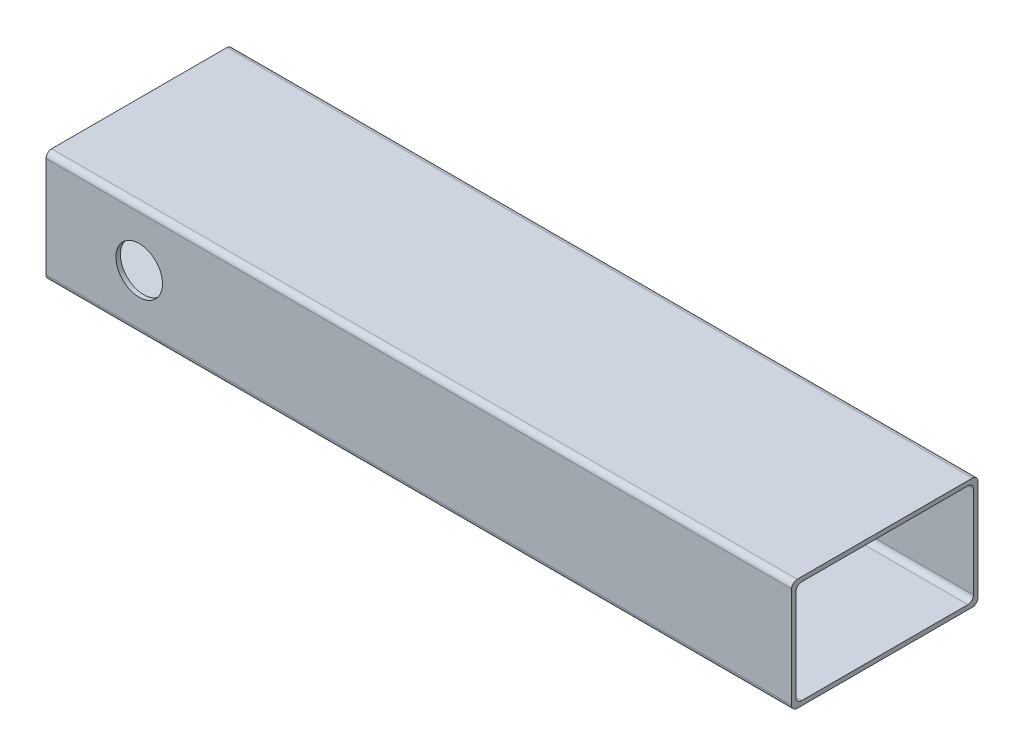
ISO-10303-21;
HEADER;
FILE_DESCRIPTION(('STEP AP214'),'2;1');
FILE_NAME('part.step','',(''),(''),'','','');
FILE_SCHEMA(('AUTOMOTIVE_DESIGN { 1 0 10303 214 1 1 1 1 }'));
ENDSEC;
DATA;
#1=APPLICATION_CONTEXT('core data for automotive mechanical design processes');
#2=APPLICATION_PROTOCOL_DEFINITION('international standard','automotive_design',2000,#1);
#3=PRODUCT_CONTEXT('',#1,'mechanical');
#4=PRODUCT('Part','Part','',(#3));
#5=PRODUCT_RELATED_PRODUCT_CATEGORY('part','',(#4));
#6=PRODUCT_DEFINITION_FORMATION('','',#4);
#7=PRODUCT_DEFINITION_CONTEXT('part definition',#1,'design');
#8=PRODUCT_DEFINITION('design','',#6,#7);
#9=PRODUCT_DEFINITION_SHAPE('','',#8);
#10=(LENGTH_UNIT() NAMED_UNIT(*) SI_UNIT(.MILLI.,.METRE.));
#11=(NAMED_UNIT(*) PLANE_ANGLE_UNIT() SI_UNIT($,.RADIAN.));
#12=(NAMED_UNIT(*) SI_UNIT($,.STERADIAN.) SOLID_ANGLE_UNIT());
#13=UNCERTAINTY_MEASURE_WITH_UNIT(LENGTH_MEASURE(1.E-05),#10,'distance_accuracy_value','');
#14=(GEOMETRIC_REPRESENTATION_CONTEXT(3) GLOBAL_UNCERTAINTY_ASSIGNED_CONTEXT((#13)) GLOBAL_UNIT_ASSIGNED_CONTEXT((#10,
#11,#12)) REPRESENTATION_CONTEXT('',''));
#15=CARTESIAN_POINT('',(0.,0.,0.));
#16=DIRECTION('',(0.,0.,1.));
#17=DIRECTION('',(1.,0.,0.));
#18=AXIS2_PLACEMENT_3D('',#15,#16,#17);
#19=CARTESIAN_POINT('',(-287.748251748252,76.2,-63.9440559440559));
#20=DIRECTION('',(1.,0.,0.));
#21=DIRECTION('',(0.,0.,-1.));
#22=AXIS2_PLACEMENT_3D('',#19,#20,#21);
#23=PLANE('',#22);
#24=DIRECTION('',(0.,0.,1.));
#25=VECTOR('',#24,1.);
#26=CARTESIAN_POINT('',(-287.748251748252,3.048,-60.8960559440559));
#27=LINE('',#26,#25);
#28=CARTESIAN_POINT('',(-287.748251748252,3.048,-57.0860559440559));
#29=VERTEX_POINT('',#28);
#30=CARTESIAN_POINT('',(-287.748251748252,3.048,56.1979440559441));
#31=VERTEX_POINT('',#30);
#32=EDGE_CURVE('E176',#29,#31,#27,.T.);
#33=ORIENTED_EDGE('',*,*,#32,.F.);
#34=CARTESIAN_POINT('',(-287.748251748252,6.858,-57.0860559440559));
#35=DIRECTION('',(1.,0.,0.));
#36=DIRECTION('',(0.,0.,-1.));
#37=AXIS2_PLACEMENT_3D('',#34,#35,#36);
#38=CIRCLE('',#37,3.81);
#39=CARTESIAN_POINT('',(-287.748251748252,6.858,-60.8960559440559));
#40=VERTEX_POINT('',#39);
#41=EDGE_CURVE('E175',#29,#40,#38,.T.);
#42=ORIENTED_EDGE('',*,*,#41,.T.);
#43=DIRECTION('',(0.,-1.,0.));
#44=VECTOR('',#43,1.);
#45=CARTESIAN_POINT('',(-287.748251748252,73.152,-60.8960559440559));
#46=LINE('',#45,#44);
#47=CARTESIAN_POINT('',(-287.748251748252,69.342,-60.8960559440559));
#48=VERTEX_POINT('',#47);
#49=EDGE_CURVE('E166',#48,#40,#46,.T.);
#50=ORIENTED_EDGE('',*,*,#49,.F.);
#51=CARTESIAN_POINT('',(-287.748251748252,69.342,-57.0860559440559));
#52=DIRECTION('',(1.,0.,0.));
#53=DIRECTION('',(0.,0.,-1.));
#54=AXIS2_PLACEMENT_3D('',#51,#52,#53);
#55=CIRCLE('',#54,3.81);
#56=CARTESIAN_POINT('',(-287.748251748252,73.152,-57.0860559440559));
#57=VERTEX_POINT('',#56);
#58=EDGE_CURVE('E149',#48,#57,#55,.T.);
#59=ORIENTED_EDGE('',*,*,#58,.T.);
#60=DIRECTION('',(0.,0.,-1.));
#61=VECTOR('',#60,1.);
#62=CARTESIAN_POINT('',(-287.748251748252,73.152,60.0079440559441));
#63=LINE('',#62,#61);
#64=CARTESIAN_POINT('',(-287.748251748252,73.152,56.1979440559441));
#65=VERTEX_POINT('',#64);
#66=EDGE_CURVE('E190',#65,#57,#63,.T.);
#67=ORIENTED_EDGE('',*,*,#66,.F.);
#68=CARTESIAN_POINT('',(-287.748251748252,69.342,56.1979440559441));
#69=DIRECTION('',(1.,0.,0.));
#70=DIRECTION('',(0.,0.,-1.));
#71=AXIS2_PLACEMENT_3D('',#68,#69,#70);
#72=CIRCLE('',#71,3.81);
#73=CARTESIAN_POINT('',(-287.748251748252,69.342,60.0079440559441));
#74=VERTEX_POINT('',#73);
#75=EDGE_CURVE('E43',#65,#74,#72,.T.);
#76=ORIENTED_EDGE('',*,*,#75,.T.);
#77=DIRECTION('',(0.,1.,0.));
#78=VECTOR('',#77,1.);
#79=CARTESIAN_POINT('',(-287.748251748252,3.048,60.0079440559441));
#80=LINE('',#79,#78);
#81=CARTESIAN_POINT('',(-287.748251748252,6.858,60.0079440559441));
#82=VERTEX_POINT('',#81);
#83=EDGE_CURVE('E180',#82,#74,#80,.T.);
#84=ORIENTED_EDGE('',*,*,#83,.F.);
#85=CARTESIAN_POINT('',(-287.748251748252,6.858,56.1979440559441));
#86=DIRECTION('',(1.,0.,0.));
#87=DIRECTION('',(0.,0.,-1.));
#88=AXIS2_PLACEMENT_3D('',#85,#86,#87);
#89=CIRCLE('',#88,3.81);
#90=EDGE_CURVE('E265',#82,#31,#89,.T.);
#91=ORIENTED_EDGE('',*,*,#90,.T.);
#92=EDGE_LOOP('',(#33,#42,#50,#59,#67,#76,#84,#91));
#93=FACE_BOUND('',#92,.T.);
#94=DIRECTION('',(0.,0.,1.));
#95=VECTOR('',#94,1.);
#96=CARTESIAN_POINT('',(-287.748251748252,76.2,-63.9440559440559));
#97=LINE('',#96,#95);
#98=CARTESIAN_POINT('',(-287.748251748252,76.2,-60.1340559440559));
#99=VERTEX_POINT('',#98);
#100=CARTESIAN_POINT('',(-287.748251748252,76.2,59.2459440559441));
#101=VERTEX_POINT('',#100);
#102=EDGE_CURVE('E192',#99,#101,#97,.T.);
#103=ORIENTED_EDGE('',*,*,#102,.F.);
#104=CARTESIAN_POINT('',(-287.748251748252,72.39,-60.1340559440559));
#105=DIRECTION('',(1.,0.,0.));
#106=DIRECTION('',(0.,0.,-1.));
#107=AXIS2_PLACEMENT_3D('',#104,#105,#106);
#108=CIRCLE('',#107,3.81);
#109=CARTESIAN_POINT('',(-287.748251748252,72.39,-63.9440559440559));
#110=VERTEX_POINT('',#109);
#111=EDGE_CURVE('E241',#99,#110,#108,.F.);
#112=ORIENTED_EDGE('',*,*,#111,.T.);
#113=DIRECTION('',(0.,-1.,0.));
#114=VECTOR('',#113,1.);
#115=CARTESIAN_POINT('',(-287.748251748252,76.2,-63.9440559440559));
#116=LINE('',#115,#114);
#117=CARTESIAN_POINT('',(-287.748251748252,3.81000000000002,-63.9440559440559));
#118=VERTEX_POINT('',#117);
#119=EDGE_CURVE('E199',#110,#118,#116,.T.);
#120=ORIENTED_EDGE('',*,*,#119,.T.);
#121=CARTESIAN_POINT('',(-287.748251748252,3.80999999999999,-60.1340559440559));
#122=DIRECTION('',(1.,0.,0.));
#123=DIRECTION('',(0.,0.,-1.));
#124=AXIS2_PLACEMENT_3D('',#121,#122,#123);
#125=CIRCLE('',#124,3.81);
#126=CARTESIAN_POINT('',(-287.748251748252,0.,-60.1340559440559));
#127=VERTEX_POINT('',#126);
#128=EDGE_CURVE('E239',#118,#127,#125,.F.);
#129=ORIENTED_EDGE('',*,*,#128,.T.);
#130=DIRECTION('',(0.,0.,1.));
#131=VECTOR('',#130,1.);
#132=CARTESIAN_POINT('',(-287.748251748252,0.,-63.9440559440559));
#133=LINE('',#132,#131);
#134=CARTESIAN_POINT('',(-287.748251748252,0.,59.2459440559441));
#135=VERTEX_POINT('',#134);
#136=EDGE_CURVE('E200',#127,#135,#133,.T.);
#137=ORIENTED_EDGE('',*,*,#136,.T.);
#138=CARTESIAN_POINT('',(-287.748251748252,3.80999999999999,59.2459440559441));
#139=DIRECTION('',(1.,0.,0.));
#140=DIRECTION('',(0.,0.,-1.));
#141=AXIS2_PLACEMENT_3D('',#138,#139,#140);
#142=CIRCLE('',#141,3.81);
#143=CARTESIAN_POINT('',(-287.748251748252,3.81000000000002,63.0559440559441));
#144=VERTEX_POINT('',#143);
#145=EDGE_CURVE('E237',#135,#144,#142,.F.);
#146=ORIENTED_EDGE('',*,*,#145,.T.);
#147=DIRECTION('',(0.,-1.,0.));
#148=VECTOR('',#147,1.);
#149=CARTESIAN_POINT('',(-287.748251748252,76.2,63.0559440559441));
#150=LINE('',#149,#148);
#151=CARTESIAN_POINT('',(-287.748251748252,72.39,63.0559440559441));
#152=VERTEX_POINT('',#151);
#153=EDGE_CURVE('E212',#152,#144,#150,.T.);
#154=ORIENTED_EDGE('',*,*,#153,.F.);
#155=CARTESIAN_POINT('',(-287.748251748252,72.39,59.2459440559441));
#156=DIRECTION('',(1.,0.,0.));
#157=DIRECTION('',(0.,0.,-1.));
#158=AXIS2_PLACEMENT_3D('',#155,#156,#157);
#159=CIRCLE('',#158,3.81);
#160=EDGE_CURVE('E235',#152,#101,#159,.F.);
#161=ORIENTED_EDGE('',*,*,#160,.T.);
#162=EDGE_LOOP('',(#103,#112,#120,#129,#137,#146,#154,#161));
#163=FACE_BOUND('',#162,.T.);
#164=ADVANCED_FACE('F34',(#93,#163),#23,.F.);
#165=CARTESIAN_POINT('',(-287.748251748252,76.2,63.0559440559441));
#166=DIRECTION('',(0.,0.,-1.));
#167=DIRECTION('',(-1.,0.,0.));
#168=AXIS2_PLACEMENT_3D('',#165,#166,#167);
#169=PLANE('',#168);
#170=CARTESIAN_POINT('',(-224.248251748252,38.1,63.0559440559441));
#171=DIRECTION('',(0.,0.,1.));
#172=DIRECTION('',(1.,0.,0.));
#173=AXIS2_PLACEMENT_3D('',#170,#171,#172);
#174=CIRCLE('',#173,15.875);
#175=CARTESIAN_POINT('',(-208.373251748252,38.1,63.0559440559441));
#176=VERTEX_POINT('',#175);
#177=EDGE_CURVE('E292',#176,#176,#174,.T.);
#178=ORIENTED_EDGE('',*,*,#177,.F.);
#179=EDGE_LOOP('',(#178));
#180=FACE_BOUND('',#179,.T.);
#181=ORIENTED_EDGE('',*,*,#153,.T.);
#182=DIRECTION('',(1.,0.,0.));
#183=VECTOR('',#182,1.);
#184=CARTESIAN_POINT('',(-287.748251748252,3.80999999999999,63.0559440559441));
#185=LINE('',#184,#183);
#186=CARTESIAN_POINT('',(220.251748251748,3.81000000000002,63.0559440559441));
#187=VERTEX_POINT('',#186);
#188=EDGE_CURVE('E160',#144,#187,#185,.T.);
#189=ORIENTED_EDGE('',*,*,#188,.T.);
#190=DIRECTION('',(0.,-1.,0.));
#191=VECTOR('',#190,1.);
#192=CARTESIAN_POINT('',(220.251748251748,76.2,63.0559440559441));
#193=LINE('',#192,#191);
#194=CARTESIAN_POINT('',(220.251748251748,72.39,63.0559440559441));
#195=VERTEX_POINT('',#194);
#196=EDGE_CURVE('E210',#195,#187,#193,.T.);
#197=ORIENTED_EDGE('',*,*,#196,.F.);
#198=DIRECTION('',(1.,0.,0.));
#199=VECTOR('',#198,1.);
#200=CARTESIAN_POINT('',(-287.748251748252,72.39,63.0559440559441));
#201=LINE('',#200,#199);
#202=EDGE_CURVE('E258',#195,#152,#201,.F.);
#203=ORIENTED_EDGE('',*,*,#202,.T.);
#204=EDGE_LOOP('',(#181,#189,#197,#203));
#205=FACE_BOUND('',#204,.T.);
#206=ADVANCED_FACE('F317',(#180,#205),#169,.F.);
#207=CARTESIAN_POINT('',(220.251748251748,76.2,-63.9440559440559));
#208=DIRECTION('',(-1.,0.,0.));
#209=DIRECTION('',(0.,0.,1.));
#210=AXIS2_PLACEMENT_3D('',#207,#208,#209);
#211=PLANE('',#210);
#212=DIRECTION('',(0.,1.,0.));
#213=VECTOR('',#212,1.);
#214=CARTESIAN_POINT('',(220.251748251748,3.048,60.0079440559441));
#215=LINE('',#214,#213);
#216=CARTESIAN_POINT('',(220.251748251748,6.858,60.0079440559441));
#217=VERTEX_POINT('',#216);
#218=CARTESIAN_POINT('',(220.251748251748,69.342,60.0079440559441));
#219=VERTEX_POINT('',#218);
#220=EDGE_CURVE('E284',#217,#219,#215,.T.);
#221=ORIENTED_EDGE('',*,*,#220,.T.);
#222=CARTESIAN_POINT('',(220.251748251748,69.342,56.1979440559441));
#223=DIRECTION('',(-1.,0.,0.));
#224=DIRECTION('',(0.,0.,1.));
#225=AXIS2_PLACEMENT_3D('',#222,#223,#224);
#226=CIRCLE('',#225,3.81);
#227=CARTESIAN_POINT('',(220.251748251748,73.152,56.1979440559441));
#228=VERTEX_POINT('',#227);
#229=EDGE_CURVE('E12',#219,#228,#226,.T.);
#230=ORIENTED_EDGE('',*,*,#229,.T.);
#231=DIRECTION('',(0.,0.,-1.));
#232=VECTOR('',#231,1.);
#233=CARTESIAN_POINT('',(220.251748251748,73.152,60.0079440559441));
#234=LINE('',#233,#232);
#235=CARTESIAN_POINT('',(220.251748251748,73.152,-57.0860559440559));
#236=VERTEX_POINT('',#235);
#237=EDGE_CURVE('E185',#228,#236,#234,.T.);
#238=ORIENTED_EDGE('',*,*,#237,.T.);
#239=CARTESIAN_POINT('',(220.251748251748,69.342,-57.0860559440559));
#240=DIRECTION('',(-1.,0.,0.));
#241=DIRECTION('',(0.,0.,1.));
#242=AXIS2_PLACEMENT_3D('',#239,#240,#241);
#243=CIRCLE('',#242,3.81);
#244=CARTESIAN_POINT('',(220.251748251748,69.342,-60.8960559440559));
#245=VERTEX_POINT('',#244);
#246=EDGE_CURVE('E159',#236,#245,#243,.T.);
#247=ORIENTED_EDGE('',*,*,#246,.T.);
#248=DIRECTION('',(0.,-1.,0.));
#249=VECTOR('',#248,1.);
#250=CARTESIAN_POINT('',(220.251748251748,73.152,-60.8960559440559));
#251=LINE('',#250,#249);
#252=CARTESIAN_POINT('',(220.251748251748,6.858,-60.8960559440559));
#253=VERTEX_POINT('',#252);
#254=EDGE_CURVE('E169',#245,#253,#251,.T.);
#255=ORIENTED_EDGE('',*,*,#254,.T.);
#256=CARTESIAN_POINT('',(220.251748251748,6.858,-57.0860559440559));
#257=DIRECTION('',(-1.,0.,0.));
#258=DIRECTION('',(0.,0.,1.));
#259=AXIS2_PLACEMENT_3D('',#256,#257,#258);
#260=CIRCLE('',#259,3.81);
#261=CARTESIAN_POINT('',(220.251748251748,3.048,-57.0860559440559));
#262=VERTEX_POINT('',#261);
#263=EDGE_CURVE('E263',#253,#262,#260,.T.);
#264=ORIENTED_EDGE('',*,*,#263,.T.);
#265=DIRECTION('',(0.,0.,1.));
#266=VECTOR('',#265,1.);
#267=CARTESIAN_POINT('',(220.251748251748,3.048,-60.8960559440559));
#268=LINE('',#267,#266);
#269=CARTESIAN_POINT('',(220.251748251748,3.048,56.1979440559441));
#270=VERTEX_POINT('',#269);
#271=EDGE_CURVE('E287',#262,#270,#268,.T.);
#272=ORIENTED_EDGE('',*,*,#271,.T.);
#273=CARTESIAN_POINT('',(220.251748251748,6.858,56.1979440559441));
#274=DIRECTION('',(-1.,0.,0.));
#275=DIRECTION('',(0.,0.,1.));
#276=AXIS2_PLACEMENT_3D('',#273,#274,#275);
#277=CIRCLE('',#276,3.81);
#278=EDGE_CURVE('E267',#270,#217,#277,.T.);
#279=ORIENTED_EDGE('',*,*,#278,.T.);
#280=EDGE_LOOP('',(#221,#230,#238,#247,#255,#264,#272,#279));
#281=FACE_BOUND('',#280,.T.);
#282=DIRECTION('',(0.,-1.,0.));
#283=VECTOR('',#282,1.);
#284=CARTESIAN_POINT('',(220.251748251748,76.2,-63.9440559440559));
#285=LINE('',#284,#283);
#286=CARTESIAN_POINT('',(220.251748251748,72.39,-63.9440559440559));
#287=VERTEX_POINT('',#286);
#288=CARTESIAN_POINT('',(220.251748251748,3.81000000000002,-63.9440559440559));
#289=VERTEX_POINT('',#288);
#290=EDGE_CURVE('E207',#287,#289,#285,.T.);
#291=ORIENTED_EDGE('',*,*,#290,.F.);
#292=CARTESIAN_POINT('',(220.251748251748,72.39,-60.1340559440559));
#293=DIRECTION('',(-1.,0.,0.));
#294=DIRECTION('',(0.,0.,1.));
#295=AXIS2_PLACEMENT_3D('',#292,#293,#294);
#296=CIRCLE('',#295,3.81);
#297=CARTESIAN_POINT('',(220.251748251748,76.2,-60.1340559440559));
#298=VERTEX_POINT('',#297);
#299=EDGE_CURVE('E252',#287,#298,#296,.F.);
#300=ORIENTED_EDGE('',*,*,#299,.T.);
#301=DIRECTION('',(0.,0.,-1.));
#302=VECTOR('',#301,1.);
#303=CARTESIAN_POINT('',(220.251748251748,76.2,-63.9440559440559));
#304=LINE('',#303,#302);
#305=CARTESIAN_POINT('',(220.251748251748,76.2,59.2459440559441));
#306=VERTEX_POINT('',#305);
#307=EDGE_CURVE('E195',#306,#298,#304,.T.);
#308=ORIENTED_EDGE('',*,*,#307,.F.);
#309=CARTESIAN_POINT('',(220.251748251748,72.39,59.2459440559441));
#310=DIRECTION('',(-1.,0.,0.));
#311=DIRECTION('',(0.,0.,1.));
#312=AXIS2_PLACEMENT_3D('',#309,#310,#311);
#313=CIRCLE('',#312,3.81);
#314=EDGE_CURVE('E58',#306,#195,#313,.F.);
#315=ORIENTED_EDGE('',*,*,#314,.T.);
#316=ORIENTED_EDGE('',*,*,#196,.T.);
#317=CARTESIAN_POINT('',(220.251748251748,3.80999999999999,59.2459440559441));
#318=DIRECTION('',(-1.,0.,0.));
#319=DIRECTION('',(0.,0.,1.));
#320=AXIS2_PLACEMENT_3D('',#317,#318,#319);
#321=CIRCLE('',#320,3.81);
#322=CARTESIAN_POINT('',(220.251748251748,0.,59.2459440559441));
#323=VERTEX_POINT('',#322);
#324=EDGE_CURVE('E50',#187,#323,#321,.F.);
#325=ORIENTED_EDGE('',*,*,#324,.T.);
#326=DIRECTION('',(0.,0.,-1.));
#327=VECTOR('',#326,1.);
#328=CARTESIAN_POINT('',(220.251748251748,0.,-63.9440559440559));
#329=LINE('',#328,#327);
#330=CARTESIAN_POINT('',(220.251748251748,0.,-60.1340559440559));
#331=VERTEX_POINT('',#330);
#332=EDGE_CURVE('E196',#323,#331,#329,.T.);
#333=ORIENTED_EDGE('',*,*,#332,.T.);
#334=CARTESIAN_POINT('',(220.251748251748,3.80999999999999,-60.1340559440559));
#335=DIRECTION('',(-1.,0.,0.));
#336=DIRECTION('',(0.,0.,1.));
#337=AXIS2_PLACEMENT_3D('',#334,#335,#336);
#338=CIRCLE('',#337,3.81);
#339=EDGE_CURVE('E250',#331,#289,#338,.F.);
#340=ORIENTED_EDGE('',*,*,#339,.T.);
#341=EDGE_LOOP('',(#291,#300,#308,#315,#316,#325,#333,#340));
#342=FACE_BOUND('',#341,.T.);
#343=ADVANCED_FACE('F283',(#281,#342),#211,.F.);
#344=CARTESIAN_POINT('',(-287.748251748252,76.2,-63.9440559440559));
#345=DIRECTION('',(0.,0.,1.));
#346=DIRECTION('',(1.,0.,0.));
#347=AXIS2_PLACEMENT_3D('',#344,#345,#346);
#348=PLANE('',#347);
#349=CARTESIAN_POINT('',(-224.248251748252,38.1,-63.9440559440559));
#350=DIRECTION('',(0.,0.,1.));
#351=DIRECTION('',(1.,0.,0.));
#352=AXIS2_PLACEMENT_3D('',#349,#350,#351);
#353=CIRCLE('',#352,15.875);
#354=CARTESIAN_POINT('',(-208.373251748252,38.1,-63.9440559440559));
#355=VERTEX_POINT('',#354);
#356=EDGE_CURVE('E295',#355,#355,#353,.T.);
#357=ORIENTED_EDGE('',*,*,#356,.T.);
#358=EDGE_LOOP('',(#357));
#359=FACE_BOUND('',#358,.T.);
#360=ORIENTED_EDGE('',*,*,#119,.F.);
#361=DIRECTION('',(-1.,0.,0.));
#362=VECTOR('',#361,1.);
#363=CARTESIAN_POINT('',(220.251748251748,72.39,-63.9440559440559));
#364=LINE('',#363,#362);
#365=EDGE_CURVE('E246',#110,#287,#364,.F.);
#366=ORIENTED_EDGE('',*,*,#365,.T.);
#367=ORIENTED_EDGE('',*,*,#290,.T.);
#368=DIRECTION('',(-1.,0.,0.));
#369=VECTOR('',#368,1.);
#370=CARTESIAN_POINT('',(-287.748251748252,3.80999999999999,-63.9440559440559));
#371=LINE('',#370,#369);
#372=EDGE_CURVE('E243',#289,#118,#371,.T.);
#373=ORIENTED_EDGE('',*,*,#372,.T.);
#374=EDGE_LOOP('',(#360,#366,#367,#373));
#375=FACE_BOUND('',#374,.T.);
#376=ADVANCED_FACE('F364',(#359,#375),#348,.F.);
#377=CARTESIAN_POINT('',(0.,76.2,0.));
#378=DIRECTION('',(0.,1.,0.));
#379=DIRECTION('',(0.,0.,1.));
#380=AXIS2_PLACEMENT_3D('',#377,#378,#379);
#381=PLANE('',#380);
#382=ORIENTED_EDGE('',*,*,#307,.T.);
#383=DIRECTION('',(-1.,0.,0.));
#384=VECTOR('',#383,1.);
#385=CARTESIAN_POINT('',(-287.748251748252,76.2,-60.1340559440559));
#386=LINE('',#385,#384);
#387=EDGE_CURVE('E232',#298,#99,#386,.T.);
#388=ORIENTED_EDGE('',*,*,#387,.T.);
#389=ORIENTED_EDGE('',*,*,#102,.T.);
#390=DIRECTION('',(1.,0.,0.));
#391=VECTOR('',#390,1.);
#392=CARTESIAN_POINT('',(220.251748251748,76.2,59.2459440559441));
#393=LINE('',#392,#391);
#394=EDGE_CURVE('E229',#101,#306,#393,.T.);
#395=ORIENTED_EDGE('',*,*,#394,.T.);
#396=EDGE_LOOP('',(#382,#388,#389,#395));
#397=FACE_BOUND('',#396,.T.);
#398=ADVANCED_FACE('F358',(#397),#381,.T.);
#399=CARTESIAN_POINT('',(0.,0.,0.));
#400=DIRECTION('',(0.,1.,0.));
#401=DIRECTION('',(0.,0.,1.));
#402=AXIS2_PLACEMENT_3D('',#399,#400,#401);
#403=PLANE('',#402);
#404=ORIENTED_EDGE('',*,*,#136,.F.);
#405=DIRECTION('',(-1.,0.,0.));
#406=VECTOR('',#405,1.);
#407=CARTESIAN_POINT('',(0.,0.,-60.1340559440559));
#408=LINE('',#407,#406);
#409=EDGE_CURVE('E256',#127,#331,#408,.F.);
#410=ORIENTED_EDGE('',*,*,#409,.T.);
#411=ORIENTED_EDGE('',*,*,#332,.F.);
#412=DIRECTION('',(1.,0.,0.));
#413=VECTOR('',#412,1.);
#414=CARTESIAN_POINT('',(0.,0.,59.2459440559441));
#415=LINE('',#414,#413);
#416=EDGE_CURVE('E254',#323,#135,#415,.F.);
#417=ORIENTED_EDGE('',*,*,#416,.T.);
#418=EDGE_LOOP('',(#404,#410,#411,#417));
#419=FACE_BOUND('',#418,.T.);
#420=ADVANCED_FACE('F370',(#419),#403,.F.);
#421=CARTESIAN_POINT('',(220.251748251748,73.152,-60.8960559440559));
#422=DIRECTION('',(0.,0.,-1.));
#423=DIRECTION('',(-1.,0.,0.));
#424=AXIS2_PLACEMENT_3D('',#421,#422,#423);
#425=PLANE('',#424);
#426=CARTESIAN_POINT('',(-224.248251748252,38.1,-60.8960559440559));
#427=DIRECTION('',(0.,0.,-1.));
#428=DIRECTION('',(-1.,0.,0.));
#429=AXIS2_PLACEMENT_3D('',#426,#427,#428);
#430=CIRCLE('',#429,15.875);
#431=CARTESIAN_POINT('',(-240.123251748252,38.1,-60.8960559440559));
#432=VERTEX_POINT('',#431);
#433=EDGE_CURVE('E177',#432,#432,#430,.T.);
#434=ORIENTED_EDGE('',*,*,#433,.T.);
#435=EDGE_LOOP('',(#434));
#436=FACE_BOUND('',#435,.T.);
#437=ORIENTED_EDGE('',*,*,#254,.F.);
#438=DIRECTION('',(-1.,0.,0.));
#439=VECTOR('',#438,1.);
#440=CARTESIAN_POINT('',(-287.748251748252,69.342,-60.8960559440559));
#441=LINE('',#440,#439);
#442=EDGE_CURVE('E153',#245,#48,#441,.T.);
#443=ORIENTED_EDGE('',*,*,#442,.T.);
#444=ORIENTED_EDGE('',*,*,#49,.T.);
#445=DIRECTION('',(-1.,0.,0.));
#446=VECTOR('',#445,1.);
#447=CARTESIAN_POINT('',(220.251748251748,6.858,-60.8960559440559));
#448=LINE('',#447,#446);
#449=EDGE_CURVE('E171',#40,#253,#448,.F.);
#450=ORIENTED_EDGE('',*,*,#449,.T.);
#451=EDGE_LOOP('',(#437,#443,#444,#450));
#452=FACE_BOUND('',#451,.T.);
#453=ADVANCED_FACE('F165',(#436,#452),#425,.F.);
#454=CARTESIAN_POINT('',(220.251748251748,73.152,60.0079440559441));
#455=DIRECTION('',(0.,1.,0.));
#456=DIRECTION('',(0.,0.,1.));
#457=AXIS2_PLACEMENT_3D('',#454,#455,#456);
#458=PLANE('',#457);
#459=ORIENTED_EDGE('',*,*,#66,.T.);
#460=DIRECTION('',(-1.,0.,0.));
#461=VECTOR('',#460,1.);
#462=CARTESIAN_POINT('',(220.251748251748,73.152,-57.0860559440559));
#463=LINE('',#462,#461);
#464=EDGE_CURVE('E154',#57,#236,#463,.F.);
#465=ORIENTED_EDGE('',*,*,#464,.T.);
#466=ORIENTED_EDGE('',*,*,#237,.F.);
#467=DIRECTION('',(-1.,0.,0.));
#468=VECTOR('',#467,1.);
#469=CARTESIAN_POINT('',(-287.748251748252,73.152,56.1979440559441));
#470=LINE('',#469,#468);
#471=EDGE_CURVE('E170',#228,#65,#470,.T.);
#472=ORIENTED_EDGE('',*,*,#471,.T.);
#473=EDGE_LOOP('',(#459,#465,#466,#472));
#474=FACE_BOUND('',#473,.T.);
#475=ADVANCED_FACE('F286',(#474),#458,.F.);
#476=CARTESIAN_POINT('',(220.251748251748,3.048,60.0079440559441));
#477=DIRECTION('',(0.,0.,1.));
#478=DIRECTION('',(1.,0.,0.));
#479=AXIS2_PLACEMENT_3D('',#476,#477,#478);
#480=PLANE('',#479);
#481=CARTESIAN_POINT('',(-224.248251748252,38.1,60.0079440559441));
#482=DIRECTION('',(0.,0.,1.));
#483=DIRECTION('',(1.,0.,0.));
#484=AXIS2_PLACEMENT_3D('',#481,#482,#483);
#485=CIRCLE('',#484,15.875);
#486=CARTESIAN_POINT('',(-208.373251748252,38.1,60.0079440559441));
#487=VERTEX_POINT('',#486);
#488=EDGE_CURVE('E38',#487,#487,#485,.T.);
#489=ORIENTED_EDGE('',*,*,#488,.T.);
#490=EDGE_LOOP('',(#489));
#491=FACE_BOUND('',#490,.T.);
#492=ORIENTED_EDGE('',*,*,#220,.F.);
#493=DIRECTION('',(-1.,0.,0.));
#494=VECTOR('',#493,1.);
#495=CARTESIAN_POINT('',(-287.748251748252,6.858,60.0079440559441));
#496=LINE('',#495,#494);
#497=EDGE_CURVE('E226',#217,#82,#496,.T.);
#498=ORIENTED_EDGE('',*,*,#497,.T.);
#499=ORIENTED_EDGE('',*,*,#83,.T.);
#500=DIRECTION('',(-1.,0.,0.));
#501=VECTOR('',#500,1.);
#502=CARTESIAN_POINT('',(220.251748251748,69.342,60.0079440559441));
#503=LINE('',#502,#501);
#504=EDGE_CURVE('E224',#74,#219,#503,.F.);
#505=ORIENTED_EDGE('',*,*,#504,.T.);
#506=EDGE_LOOP('',(#492,#498,#499,#505));
#507=FACE_BOUND('',#506,.T.);
#508=ADVANCED_FACE('F275',(#491,#507),#480,.F.);
#509=CARTESIAN_POINT('',(220.251748251748,3.048,-60.8960559440559));
#510=DIRECTION('',(0.,-1.,0.));
#511=DIRECTION('',(0.,0.,-1.));
#512=AXIS2_PLACEMENT_3D('',#509,#510,#511);
#513=PLANE('',#512);
#514=ORIENTED_EDGE('',*,*,#271,.F.);
#515=DIRECTION('',(-1.,0.,0.));
#516=VECTOR('',#515,1.);
#517=CARTESIAN_POINT('',(-287.748251748252,3.048,-57.0860559440559));
#518=LINE('',#517,#516);
#519=EDGE_CURVE('E221',#262,#29,#518,.T.);
#520=ORIENTED_EDGE('',*,*,#519,.T.);
#521=ORIENTED_EDGE('',*,*,#32,.T.);
#522=DIRECTION('',(-1.,0.,0.));
#523=VECTOR('',#522,1.);
#524=CARTESIAN_POINT('',(220.251748251748,3.048,56.1979440559441));
#525=LINE('',#524,#523);
#526=EDGE_CURVE('E219',#31,#270,#525,.F.);
#527=ORIENTED_EDGE('',*,*,#526,.T.);
#528=EDGE_LOOP('',(#514,#520,#521,#527));
#529=FACE_BOUND('',#528,.T.);
#530=ADVANCED_FACE('F329',(#529),#513,.F.);
#531=CARTESIAN_POINT('',(220.251748251748,69.342,-57.0860559440559));
#532=DIRECTION('',(1.,0.,0.));
#533=DIRECTION('',(0.,0.,-1.));
#534=AXIS2_PLACEMENT_3D('',#531,#532,#533);
#535=CYLINDRICAL_SURFACE('',#534,3.81);
#536=ORIENTED_EDGE('',*,*,#246,.F.);
#537=ORIENTED_EDGE('',*,*,#464,.F.);
#538=ORIENTED_EDGE('',*,*,#58,.F.);
#539=ORIENTED_EDGE('',*,*,#442,.F.);
#540=EDGE_LOOP('',(#536,#537,#538,#539));
#541=FACE_BOUND('',#540,.T.);
#542=ADVANCED_FACE('F152',(#541),#535,.F.);
#543=CARTESIAN_POINT('',(220.251748251748,6.858,-57.0860559440559));
#544=DIRECTION('',(1.,0.,0.));
#545=DIRECTION('',(0.,0.,-1.));
#546=AXIS2_PLACEMENT_3D('',#543,#544,#545);
#547=CYLINDRICAL_SURFACE('',#546,3.81);
#548=ORIENTED_EDGE('',*,*,#263,.F.);
#549=ORIENTED_EDGE('',*,*,#449,.F.);
#550=ORIENTED_EDGE('',*,*,#41,.F.);
#551=ORIENTED_EDGE('',*,*,#519,.F.);
#552=EDGE_LOOP('',(#548,#549,#550,#551));
#553=FACE_BOUND('',#552,.T.);
#554=ADVANCED_FACE('F328',(#553),#547,.F.);
#555=CARTESIAN_POINT('',(220.251748251748,6.858,56.1979440559441));
#556=DIRECTION('',(1.,0.,0.));
#557=DIRECTION('',(0.,0.,-1.));
#558=AXIS2_PLACEMENT_3D('',#555,#556,#557);
#559=CYLINDRICAL_SURFACE('',#558,3.81);
#560=ORIENTED_EDGE('',*,*,#278,.F.);
#561=ORIENTED_EDGE('',*,*,#526,.F.);
#562=ORIENTED_EDGE('',*,*,#90,.F.);
#563=ORIENTED_EDGE('',*,*,#497,.F.);
#564=EDGE_LOOP('',(#560,#561,#562,#563));
#565=FACE_BOUND('',#564,.T.);
#566=ADVANCED_FACE('F332',(#565),#559,.F.);
#567=CARTESIAN_POINT('',(220.251748251748,69.342,56.1979440559441));
#568=DIRECTION('',(1.,0.,0.));
#569=DIRECTION('',(0.,0.,-1.));
#570=AXIS2_PLACEMENT_3D('',#567,#568,#569);
#571=CYLINDRICAL_SURFACE('',#570,3.81);
#572=ORIENTED_EDGE('',*,*,#229,.F.);
#573=ORIENTED_EDGE('',*,*,#504,.F.);
#574=ORIENTED_EDGE('',*,*,#75,.F.);
#575=ORIENTED_EDGE('',*,*,#471,.F.);
#576=EDGE_LOOP('',(#572,#573,#574,#575));
#577=FACE_BOUND('',#576,.T.);
#578=ADVANCED_FACE('F279',(#577),#571,.F.);
#579=CARTESIAN_POINT('',(0.,72.39,-60.1340559440559));
#580=DIRECTION('',(1.,0.,0.));
#581=DIRECTION('',(0.,0.,-1.));
#582=AXIS2_PLACEMENT_3D('',#579,#580,#581);
#583=CYLINDRICAL_SURFACE('',#582,3.81);
#584=ORIENTED_EDGE('',*,*,#299,.F.);
#585=ORIENTED_EDGE('',*,*,#365,.F.);
#586=ORIENTED_EDGE('',*,*,#111,.F.);
#587=ORIENTED_EDGE('',*,*,#387,.F.);
#588=EDGE_LOOP('',(#584,#585,#586,#587));
#589=FACE_BOUND('',#588,.T.);
#590=ADVANCED_FACE('F339',(#589),#583,.T.);
#591=CARTESIAN_POINT('',(-287.748251748252,3.80999999999999,-60.1340559440559));
#592=DIRECTION('',(-1.,0.,0.));
#593=DIRECTION('',(0.,0.,1.));
#594=AXIS2_PLACEMENT_3D('',#591,#592,#593);
#595=CYLINDRICAL_SURFACE('',#594,3.81);
#596=ORIENTED_EDGE('',*,*,#339,.F.);
#597=ORIENTED_EDGE('',*,*,#409,.F.);
#598=ORIENTED_EDGE('',*,*,#128,.F.);
#599=ORIENTED_EDGE('',*,*,#372,.F.);
#600=EDGE_LOOP('',(#596,#597,#598,#599));
#601=FACE_BOUND('',#600,.T.);
#602=ADVANCED_FACE('F342',(#601),#595,.T.);
#603=CARTESIAN_POINT('',(-287.748251748252,3.80999999999999,59.2459440559441));
#604=DIRECTION('',(1.,0.,0.));
#605=DIRECTION('',(0.,0.,-1.));
#606=AXIS2_PLACEMENT_3D('',#603,#604,#605);
#607=CYLINDRICAL_SURFACE('',#606,3.81);
#608=ORIENTED_EDGE('',*,*,#145,.F.);
#609=ORIENTED_EDGE('',*,*,#416,.F.);
#610=ORIENTED_EDGE('',*,*,#324,.F.);
#611=ORIENTED_EDGE('',*,*,#188,.F.);
#612=EDGE_LOOP('',(#608,#609,#610,#611));
#613=FACE_BOUND('',#612,.T.);
#614=ADVANCED_FACE('F313',(#613),#607,.T.);
#615=CARTESIAN_POINT('',(0.,72.39,59.2459440559441));
#616=DIRECTION('',(-1.,0.,0.));
#617=DIRECTION('',(0.,0.,1.));
#618=AXIS2_PLACEMENT_3D('',#615,#616,#617);
#619=CYLINDRICAL_SURFACE('',#618,3.81);
#620=ORIENTED_EDGE('',*,*,#160,.F.);
#621=ORIENTED_EDGE('',*,*,#202,.F.);
#622=ORIENTED_EDGE('',*,*,#314,.F.);
#623=ORIENTED_EDGE('',*,*,#394,.F.);
#624=EDGE_LOOP('',(#620,#621,#622,#623));
#625=FACE_BOUND('',#624,.T.);
#626=ADVANCED_FACE('F36',(#625),#619,.T.);
#627=CARTESIAN_POINT('',(-224.248251748252,38.1,-63.9440559440559));
#628=DIRECTION('',(0.,0.,1.));
#629=DIRECTION('',(1.,0.,0.));
#630=AXIS2_PLACEMENT_3D('',#627,#628,#629);
#631=CYLINDRICAL_SURFACE('',#630,15.875);
#632=ORIENTED_EDGE('',*,*,#177,.T.);
#633=EDGE_LOOP('',(#632));
#634=FACE_BOUND('',#633,.T.);
#635=ORIENTED_EDGE('',*,*,#488,.F.);
#636=EDGE_LOOP('',(#635));
#637=FACE_BOUND('',#636,.T.);
#638=ADVANCED_FACE('F303',(#634,#637),#631,.F.);
#639=ORIENTED_EDGE('',*,*,#356,.F.);
#640=EDGE_LOOP('',(#639));
#641=FACE_BOUND('',#640,.T.);
#642=ORIENTED_EDGE('',*,*,#433,.F.);
#643=EDGE_LOOP('',(#642));
#644=FACE_BOUND('',#643,.T.);
#645=ADVANCED_FACE('F305',(#641,#644),#631,.F.);
#646=CLOSED_SHELL('',(#164,#206,#343,#376,#398,#420,#453,#475,#508,#530,#542,#554,#566,#578,
#590,#602,#614,#626,#638,#645));
#647=MANIFOLD_SOLID_BREP('B2',#646);
#648=ADVANCED_BREP_SHAPE_REPRESENTATION('',(#18,#647),#14);
#649=SHAPE_DEFINITION_REPRESENTATION(#9,#648);
ENDSEC;
END-ISO-10303-21;
